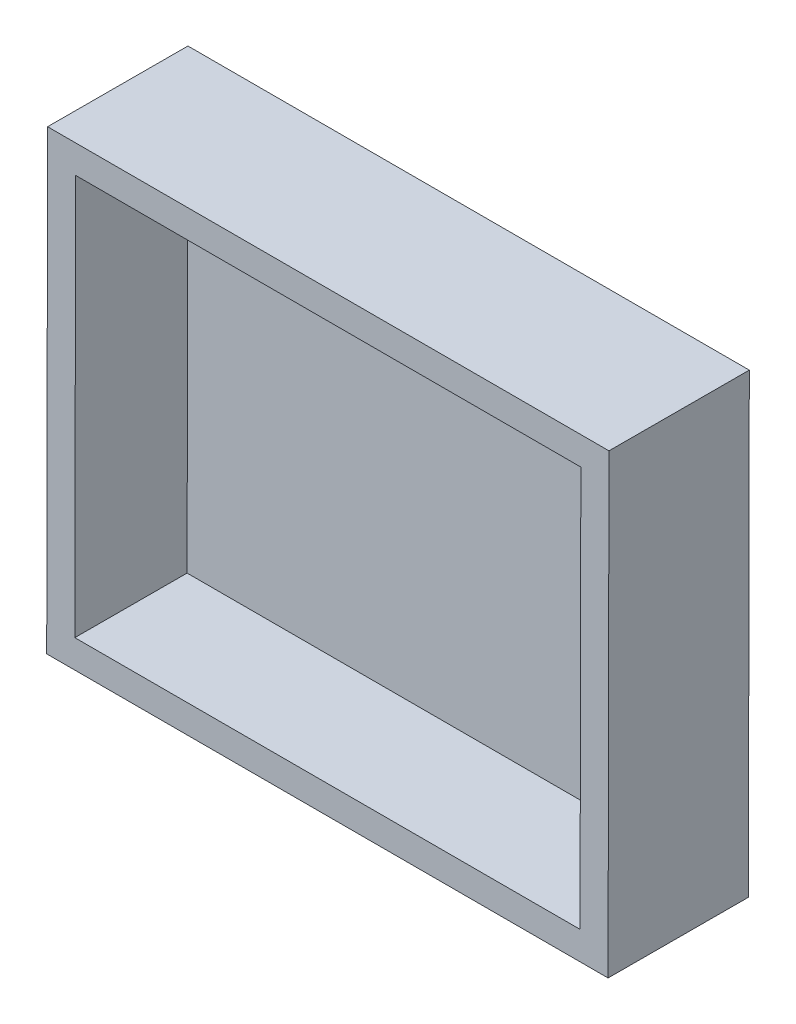
ISO-10303-21;
HEADER;
FILE_DESCRIPTION(('STEP AP214'),'2;1');
FILE_NAME('part.step','',(''),(''),'','','');
FILE_SCHEMA(('AUTOMOTIVE_DESIGN { 1 0 10303 214 1 1 1 1 }'));
ENDSEC;
DATA;
#1=APPLICATION_CONTEXT('core data for automotive mechanical design processes');
#2=APPLICATION_PROTOCOL_DEFINITION('international standard','automotive_design',2000,#1);
#3=PRODUCT_CONTEXT('',#1,'mechanical');
#4=PRODUCT('Part','Part','',(#3));
#5=PRODUCT_RELATED_PRODUCT_CATEGORY('part','',(#4));
#6=PRODUCT_DEFINITION_FORMATION('','',#4);
#7=PRODUCT_DEFINITION_CONTEXT('part definition',#1,'design');
#8=PRODUCT_DEFINITION('design','',#6,#7);
#9=PRODUCT_DEFINITION_SHAPE('','',#8);
#10=(LENGTH_UNIT() NAMED_UNIT(*) SI_UNIT(.MILLI.,.METRE.));
#11=(NAMED_UNIT(*) PLANE_ANGLE_UNIT() SI_UNIT($,.RADIAN.));
#12=(NAMED_UNIT(*) SI_UNIT($,.STERADIAN.) SOLID_ANGLE_UNIT());
#13=UNCERTAINTY_MEASURE_WITH_UNIT(LENGTH_MEASURE(1.E-05),#10,'distance_accuracy_value','');
#14=(GEOMETRIC_REPRESENTATION_CONTEXT(3) GLOBAL_UNCERTAINTY_ASSIGNED_CONTEXT((#13)) GLOBAL_UNIT_ASSIGNED_CONTEXT((#10,
#11,#12)) REPRESENTATION_CONTEXT('',''));
#15=CARTESIAN_POINT('',(0.,0.,0.));
#16=DIRECTION('',(0.,0.,1.));
#17=DIRECTION('',(1.,0.,0.));
#18=AXIS2_PLACEMENT_3D('',#15,#16,#17);
#19=CARTESIAN_POINT('',(-75.0639988479632,32.1451252430194,19.8847443341761));
#20=DIRECTION('',(1.,-2.29688322373399E-11,-1.17776077545555E-08));
#21=DIRECTION('',(-1.17776077545555E-08,0.,-1.));
#22=AXIS2_PLACEMENT_3D('',#19,#20,#21);
#23=PLANE('',#22);
#24=DIRECTION('',(0.,-0.999998098306605,0.0019502264416651));
#25=VECTOR('',#24,1.);
#26=CARTESIAN_POINT('',(-75.0639990835158,32.1061207141861,-0.115217631956002));
#27=LINE('',#26,#25);
#28=CARTESIAN_POINT('',(-75.0639990835158,32.1061207141861,-0.115217631956002));
#29=VERTEX_POINT('',#28);
#30=CARTESIAN_POINT('',(-75.0639990835158,-32.8936330254354,0.011546847555902));
#31=VERTEX_POINT('',#30);
#32=EDGE_CURVE('E108',#29,#31,#27,.T.);
#33=ORIENTED_EDGE('',*,*,#32,.T.);
#34=DIRECTION('',(-1.17776301515805E-08,-0.0019502264416651,-0.999998098306605));
#35=VECTOR('',#34,1.);
#36=CARTESIAN_POINT('',(-75.0639988479631,-32.8546284966021,20.011508813688));
#37=LINE('',#36,#35);
#38=CARTESIAN_POINT('',(-75.0639988479631,-32.8546284966021,20.011508813688));
#39=VERTEX_POINT('',#38);
#40=EDGE_CURVE('E11',#39,#31,#37,.T.);
#41=ORIENTED_EDGE('',*,*,#40,.F.);
#42=DIRECTION('',(0.,-0.999998098306605,0.0019502264416651));
#43=VECTOR('',#42,1.);
#44=CARTESIAN_POINT('',(-75.0639988479632,32.1451252430194,19.8847443341761));
#45=LINE('',#44,#43);
#46=CARTESIAN_POINT('',(-75.0639988479632,32.1451252430194,19.8847443341761));
#47=VERTEX_POINT('',#46);
#48=EDGE_CURVE('E117',#47,#39,#45,.T.);
#49=ORIENTED_EDGE('',*,*,#48,.F.);
#50=DIRECTION('',(-1.17776301515805E-08,-0.0019502264416651,-0.999998098306605));
#51=VECTOR('',#50,1.);
#52=CARTESIAN_POINT('',(-75.0639988479632,32.1451252430194,19.8847443341761));
#53=LINE('',#52,#51);
#54=EDGE_CURVE('E101',#47,#29,#53,.T.);
#55=ORIENTED_EDGE('',*,*,#54,.T.);
#56=EDGE_LOOP('',(#33,#41,#49,#55));
#57=FACE_BOUND('',#56,.T.);
#58=ADVANCED_FACE('F35',(#57),#23,.F.);
#59=CARTESIAN_POINT('',(4.93600192566122,-32.8546284984396,20.0115078714794));
#60=DIRECTION('',(0.,0.999998098306605,-0.0019502264416651));
#61=DIRECTION('',(0.,0.0019502264416651,0.999998098306605));
#62=AXIS2_PLACEMENT_3D('',#59,#60,#61);
#63=PLANE('',#62);
#64=DIRECTION('',(1.,-2.29689164535393E-11,-1.17776077542398E-08));
#65=VECTOR('',#64,1.);
#66=CARTESIAN_POINT('',(4.93600169010861,-32.8936330272729,0.0115459053472726));
#67=LINE('',#66,#65);
#68=CARTESIAN_POINT('',(4.93600169010861,-32.8936330272729,0.0115459053472726));
#69=VERTEX_POINT('',#68);
#70=EDGE_CURVE('E111',#31,#69,#67,.T.);
#71=ORIENTED_EDGE('',*,*,#70,.T.);
#72=DIRECTION('',(-1.17776301515805E-08,-0.0019502264416651,-0.999998098306605));
#73=VECTOR('',#72,1.);
#74=CARTESIAN_POINT('',(4.93600192566122,-32.8546284984396,20.0115078714794));
#75=LINE('',#74,#73);
#76=CARTESIAN_POINT('',(4.93600192566122,-32.8546284984396,20.0115078714794));
#77=VERTEX_POINT('',#76);
#78=EDGE_CURVE('E43',#77,#69,#75,.T.);
#79=ORIENTED_EDGE('',*,*,#78,.F.);
#80=DIRECTION('',(1.,-2.29702202117127E-11,-1.17776077523297E-08));
#81=VECTOR('',#80,1.);
#82=CARTESIAN_POINT('',(-75.0639988479631,-32.8546284966021,20.011508813688));
#83=LINE('',#82,#81);
#84=EDGE_CURVE('E82',#39,#77,#83,.T.);
#85=ORIENTED_EDGE('',*,*,#84,.F.);
#86=ORIENTED_EDGE('',*,*,#40,.T.);
#87=EDGE_LOOP('',(#71,#79,#85,#86));
#88=FACE_BOUND('',#87,.T.);
#89=ADVANCED_FACE('F211',(#88),#63,.F.);
#90=CARTESIAN_POINT('',(4.93600192566121,32.1451242871951,19.884743393828));
#91=DIRECTION('',(-1.,2.29689256455239E-11,1.17776077543733E-08));
#92=DIRECTION('',(1.17776077543733E-08,0.,1.));
#93=AXIS2_PLACEMENT_3D('',#90,#91,#92);
#94=PLANE('',#93);
#95=DIRECTION('',(0.,0.999998098306605,-0.0019502264416651));
#96=VECTOR('',#95,1.);
#97=CARTESIAN_POINT('',(4.93600169010861,32.1061197583618,-0.115218572304137));
#98=LINE('',#97,#96);
#99=CARTESIAN_POINT('',(4.93600169010861,32.1061197583618,-0.115218572304137));
#100=VERTEX_POINT('',#99);
#101=EDGE_CURVE('E100',#69,#100,#98,.T.);
#102=ORIENTED_EDGE('',*,*,#101,.T.);
#103=DIRECTION('',(-1.17776301515805E-08,-0.0019502264416651,-0.999998098306605));
#104=VECTOR('',#103,1.);
#105=CARTESIAN_POINT('',(4.93600192566121,32.1451242871951,19.884743393828));
#106=LINE('',#105,#104);
#107=CARTESIAN_POINT('',(4.93600192566121,32.1451242871951,19.884743393828));
#108=VERTEX_POINT('',#107);
#109=EDGE_CURVE('E97',#108,#100,#106,.T.);
#110=ORIENTED_EDGE('',*,*,#109,.F.);
#111=DIRECTION('',(0.,0.999998098306605,-0.0019502264416651));
#112=VECTOR('',#111,1.);
#113=CARTESIAN_POINT('',(4.93600192566121,32.1451242871951,19.884743393828));
#114=LINE('',#113,#112);
#115=EDGE_CURVE('E88',#77,#108,#114,.T.);
#116=ORIENTED_EDGE('',*,*,#115,.F.);
#117=ORIENTED_EDGE('',*,*,#78,.T.);
#118=EDGE_LOOP('',(#102,#110,#116,#117));
#119=FACE_BOUND('',#118,.T.);
#120=ADVANCED_FACE('F98',(#119),#94,.F.);
#121=CARTESIAN_POINT('',(-62.4959980037294,32.1451252427308,19.8847441861551));
#122=DIRECTION('',(0.,-0.999998098306605,0.0019502264416651));
#123=DIRECTION('',(0.,-0.0019502264416651,-0.999998098306605));
#124=AXIS2_PLACEMENT_3D('',#121,#122,#123);
#125=PLANE('',#124);
#126=DIRECTION('',(-1.,2.2968797326489E-11,1.1777607754044E-08));
#127=VECTOR('',#126,1.);
#128=CARTESIAN_POINT('',(-62.495998239282,32.1061207138975,-0.115217779976986));
#129=LINE('',#128,#127);
#130=CARTESIAN_POINT('',(-62.495998239282,32.1061207138975,-0.115217779976986));
#131=VERTEX_POINT('',#130);
#132=EDGE_CURVE('E74',#131,#29,#129,.T.);
#133=ORIENTED_EDGE('',*,*,#132,.T.);
#134=ORIENTED_EDGE('',*,*,#54,.F.);
#135=DIRECTION('',(-1.,2.2968797326489E-11,1.1777607754044E-08));
#136=VECTOR('',#135,1.);
#137=CARTESIAN_POINT('',(-62.4959980037294,32.1451252427308,19.8847441861551));
#138=LINE('',#137,#136);
#139=CARTESIAN_POINT('',(-62.4959980037294,32.1451252427308,19.8847441861551));
#140=VERTEX_POINT('',#139);
#141=EDGE_CURVE('E51',#140,#47,#138,.T.);
#142=ORIENTED_EDGE('',*,*,#141,.F.);
#143=DIRECTION('',(-1.,1.41703588358429E-08,1.17500170869422E-08));
#144=VECTOR('',#143,1.);
#145=CARTESIAN_POINT('',(4.93600192566121,32.1451242871951,19.884743393828));
#146=LINE('',#145,#144);
#147=EDGE_CURVE('E92',#108,#140,#146,.T.);
#148=ORIENTED_EDGE('',*,*,#147,.F.);
#149=ORIENTED_EDGE('',*,*,#109,.T.);
#150=DIRECTION('',(-1.,1.4170360004131E-08,1.17500170857195E-08));
#151=VECTOR('',#150,1.);
#152=CARTESIAN_POINT('',(-2.49599815401732,32.1061198636759,-0.115218484978012));
#153=LINE('',#152,#151);
#154=EDGE_CURVE('E71',#100,#131,#153,.T.);
#155=ORIENTED_EDGE('',*,*,#154,.T.);
#156=EDGE_LOOP('',(#133,#134,#142,#148,#149,#155));
#157=FACE_BOUND('',#156,.T.);
#158=ADVANCED_FACE('F103',(#157),#125,.F.);
#159=CARTESIAN_POINT('',(2.34933051499001E-07,0.0389019389433778,19.9473579748016));
#160=DIRECTION('',(1.17776301520616E-08,0.0019502264416651,0.999998098306605));
#161=DIRECTION('',(0.,-0.999998098306605,0.0019502264416651));
#162=AXIS2_PLACEMENT_3D('',#159,#160,#161);
#163=PLANE('',#162);
#164=DIRECTION('',(0.,-0.999998098306605,0.0019502264416651));
#165=VECTOR('',#164,1.);
#166=CARTESIAN_POINT('',(-71.0639988479632,32.1451252429276,19.8847442870657));
#167=LINE('',#166,#165);
#168=CARTESIAN_POINT('',(-71.0639988479632,28.1451328497011,19.8925451928323));
#169=VERTEX_POINT('',#168);
#170=CARTESIAN_POINT('',(-71.0639988479631,-28.8546361034676,20.0037078608109));
#171=VERTEX_POINT('',#170);
#172=EDGE_CURVE('E136',#169,#171,#167,.T.);
#173=ORIENTED_EDGE('',*,*,#172,.F.);
#174=DIRECTION('',(-1.,2.29687973285574E-11,1.17776077551046E-08));
#175=VECTOR('',#174,1.);
#176=CARTESIAN_POINT('',(-62.4959980037294,28.1451328495043,19.8925450919218));
#177=LINE('',#176,#175);
#178=CARTESIAN_POINT('',(0.936001925661209,28.1451328480474,19.8925443448446));
#179=VERTEX_POINT('',#178);
#180=EDGE_CURVE('E126',#179,#169,#177,.T.);
#181=ORIENTED_EDGE('',*,*,#180,.F.);
#182=DIRECTION('',(0.,0.999998098306605,-0.0019502264416651));
#183=VECTOR('',#182,1.);
#184=CARTESIAN_POINT('',(0.936001925661209,32.1451242872869,19.8847434409384));
#185=LINE('',#184,#183);
#186=CARTESIAN_POINT('',(0.936001925661216,-28.8546361051213,20.0037070128231));
#187=VERTEX_POINT('',#186);
#188=EDGE_CURVE('E130',#187,#179,#185,.T.);
#189=ORIENTED_EDGE('',*,*,#188,.F.);
#190=DIRECTION('',(1.,-2.29689164547729E-11,-1.17776077548723E-08));
#191=VECTOR('',#190,1.);
#192=CARTESIAN_POINT('',(4.93600192566122,-28.8546361052132,20.0037069657127));
#193=LINE('',#192,#191);
#194=EDGE_CURVE('E133',#171,#187,#193,.T.);
#195=ORIENTED_EDGE('',*,*,#194,.F.);
#196=EDGE_LOOP('',(#173,#181,#189,#195));
#197=FACE_BOUND('',#196,.T.);
#198=ORIENTED_EDGE('',*,*,#48,.T.);
#199=ORIENTED_EDGE('',*,*,#84,.T.);
#200=ORIENTED_EDGE('',*,*,#115,.T.);
#201=ORIENTED_EDGE('',*,*,#147,.T.);
#202=ORIENTED_EDGE('',*,*,#141,.T.);
#203=EDGE_LOOP('',(#198,#199,#200,#201,#202));
#204=FACE_BOUND('',#203,.T.);
#205=ADVANCED_FACE('F90',(#197,#204),#163,.T.);
#206=CARTESIAN_POINT('',(-6.19551532609474E-10,-0.000102589889924301,-0.0526039913304602));
#207=DIRECTION('',(1.17776301520616E-08,0.0019502264416651,0.999998098306605));
#208=DIRECTION('',(0.,-0.999998098306605,0.0019502264416651));
#209=AXIS2_PLACEMENT_3D('',#206,#207,#208);
#210=PLANE('',#209);
#211=ORIENTED_EDGE('',*,*,#32,.F.);
#212=ORIENTED_EDGE('',*,*,#132,.F.);
#213=ORIENTED_EDGE('',*,*,#154,.F.);
#214=ORIENTED_EDGE('',*,*,#101,.F.);
#215=ORIENTED_EDGE('',*,*,#70,.F.);
#216=EDGE_LOOP('',(#211,#212,#213,#214,#215));
#217=FACE_BOUND('',#216,.T.);
#218=ADVANCED_FACE('F120',(#217),#210,.F.);
#219=CARTESIAN_POINT('',(-71.0639988479632,32.1451252429276,19.8847442870657));
#220=DIRECTION('',(1.,-2.29688322373399E-11,-1.17776077545555E-08));
#221=DIRECTION('',(-1.17776077545555E-08,0.,-1.));
#222=AXIS2_PLACEMENT_3D('',#219,#220,#221);
#223=PLANE('',#222);
#224=DIRECTION('',(0.,-0.999998098306605,0.0019502264416651));
#225=VECTOR('',#224,1.);
#226=CARTESIAN_POINT('',(-71.0639990364052,32.1139216198609,3.88477471415999));
#227=LINE('',#226,#225);
#228=CARTESIAN_POINT('',(-71.0639990364052,28.1139292266345,3.89257561992665));
#229=VERTEX_POINT('',#228);
#230=CARTESIAN_POINT('',(-71.0639990364052,-28.8858397265342,4.00373828790523));
#231=VERTEX_POINT('',#230);
#232=EDGE_CURVE('E157',#229,#231,#227,.T.);
#233=ORIENTED_EDGE('',*,*,#232,.F.);
#234=DIRECTION('',(-1.17776301515805E-08,-0.0019502264416651,-0.999998098306605));
#235=VECTOR('',#234,1.);
#236=CARTESIAN_POINT('',(-71.0639988479632,28.1451328497011,19.8925451928323));
#237=LINE('',#236,#235);
#238=EDGE_CURVE('E129',#169,#229,#237,.T.);
#239=ORIENTED_EDGE('',*,*,#238,.F.);
#240=ORIENTED_EDGE('',*,*,#172,.T.);
#241=DIRECTION('',(-1.17776301515805E-08,-0.0019502264416651,-0.999998098306605));
#242=VECTOR('',#241,1.);
#243=CARTESIAN_POINT('',(-71.0639988479631,-28.8546361034676,20.0037078608109));
#244=LINE('',#243,#242);
#245=EDGE_CURVE('E112',#171,#231,#244,.T.);
#246=ORIENTED_EDGE('',*,*,#245,.T.);
#247=EDGE_LOOP('',(#233,#239,#240,#246));
#248=FACE_BOUND('',#247,.T.);
#249=ADVANCED_FACE('F174',(#248),#223,.T.);
#250=CARTESIAN_POINT('',(4.93600192566122,-28.8546361052132,20.0037069657127));
#251=DIRECTION('',(0.,0.999998098306605,-0.0019502264416651));
#252=DIRECTION('',(0.,0.0019502264416651,0.999998098306605));
#253=AXIS2_PLACEMENT_3D('',#250,#251,#252);
#254=PLANE('',#253);
#255=DIRECTION('',(1.,-2.29689164547729E-11,-1.17776077548723E-08));
#256=VECTOR('',#255,1.);
#257=CARTESIAN_POINT('',(4.93600173721913,-28.8858397282798,4.00373739280703));
#258=LINE('',#257,#256);
#259=CARTESIAN_POINT('',(0.936001737219134,-28.885839728188,4.00373743991746));
#260=VERTEX_POINT('',#259);
#261=EDGE_CURVE('E152',#231,#260,#258,.T.);
#262=ORIENTED_EDGE('',*,*,#261,.F.);
#263=ORIENTED_EDGE('',*,*,#245,.F.);
#264=ORIENTED_EDGE('',*,*,#194,.T.);
#265=DIRECTION('',(-1.17776301515805E-08,-0.0019502264416651,-0.999998098306605));
#266=VECTOR('',#265,1.);
#267=CARTESIAN_POINT('',(0.936001925661216,-28.8546361051213,20.0037070128231));
#268=LINE('',#267,#266);
#269=EDGE_CURVE('E149',#187,#260,#268,.T.);
#270=ORIENTED_EDGE('',*,*,#269,.T.);
#271=EDGE_LOOP('',(#262,#263,#264,#270));
#272=FACE_BOUND('',#271,.T.);
#273=ADVANCED_FACE('F199',(#272),#254,.T.);
#274=CARTESIAN_POINT('',(0.936001925661209,32.1451242872869,19.8847434409384));
#275=DIRECTION('',(-1.,2.29689256455239E-11,1.17776077543733E-08));
#276=DIRECTION('',(1.17776077543733E-08,0.,1.));
#277=AXIS2_PLACEMENT_3D('',#274,#275,#276);
#278=PLANE('',#277);
#279=DIRECTION('',(0.,0.999998098306605,-0.0019502264416651));
#280=VECTOR('',#279,1.);
#281=CARTESIAN_POINT('',(0.936001737219126,32.1139206642203,3.88477386803271));
#282=LINE('',#281,#280);
#283=CARTESIAN_POINT('',(0.936001737219127,28.1139292249807,3.89257477193888));
#284=VERTEX_POINT('',#283);
#285=EDGE_CURVE('E143',#260,#284,#282,.T.);
#286=ORIENTED_EDGE('',*,*,#285,.F.);
#287=ORIENTED_EDGE('',*,*,#269,.F.);
#288=ORIENTED_EDGE('',*,*,#188,.T.);
#289=DIRECTION('',(-1.17776301515805E-08,-0.0019502264416651,-0.999998098306605));
#290=VECTOR('',#289,1.);
#291=CARTESIAN_POINT('',(0.936001925661213,28.1451328480474,19.8925443448446));
#292=LINE('',#291,#290);
#293=EDGE_CURVE('E146',#179,#284,#292,.T.);
#294=ORIENTED_EDGE('',*,*,#293,.T.);
#295=EDGE_LOOP('',(#286,#287,#288,#294));
#296=FACE_BOUND('',#295,.T.);
#297=ADVANCED_FACE('F201',(#296),#278,.T.);
#298=CARTESIAN_POINT('',(-62.4959980037294,28.1451328495043,19.8925450919218));
#299=DIRECTION('',(0.,-0.999998098306605,0.0019502264416651));
#300=DIRECTION('',(0.,-0.0019502264416651,-0.999998098306605));
#301=AXIS2_PLACEMENT_3D('',#298,#299,#300);
#302=PLANE('',#301);
#303=DIRECTION('',(-1.,2.29687973285574E-11,1.17776077551046E-08));
#304=VECTOR('',#303,1.);
#305=CARTESIAN_POINT('',(-62.4959981921714,28.1139292264377,3.89257551901609));
#306=LINE('',#305,#304);
#307=CARTESIAN_POINT('',(-62.4959981921714,28.1139292264377,3.89257551901609));
#308=VERTEX_POINT('',#307);
#309=EDGE_CURVE('E139',#308,#229,#306,.T.);
#310=ORIENTED_EDGE('',*,*,#309,.F.);
#311=DIRECTION('',(-1.,2.29687973285574E-11,1.17776077551046E-08));
#312=VECTOR('',#311,1.);
#313=CARTESIAN_POINT('',(-62.4959981921714,28.1139292264377,3.89257551901609));
#314=LINE('',#313,#312);
#315=EDGE_CURVE('E140',#284,#308,#314,.T.);
#316=ORIENTED_EDGE('',*,*,#315,.F.);
#317=ORIENTED_EDGE('',*,*,#293,.F.);
#318=ORIENTED_EDGE('',*,*,#180,.T.);
#319=ORIENTED_EDGE('',*,*,#238,.T.);
#320=EDGE_LOOP('',(#310,#316,#317,#318,#319));
#321=FACE_BOUND('',#320,.T.);
#322=ADVANCED_FACE('F195',(#321),#302,.T.);
#323=CARTESIAN_POINT('',(4.6490969075637E-08,0.00769831587673612,3.94738840189596));
#324=DIRECTION('',(1.17776301520616E-08,0.0019502264416651,0.999998098306605));
#325=DIRECTION('',(0.,-0.999998098306605,0.0019502264416651));
#326=AXIS2_PLACEMENT_3D('',#323,#324,#325);
#327=PLANE('',#326);
#328=ORIENTED_EDGE('',*,*,#232,.T.);
#329=ORIENTED_EDGE('',*,*,#261,.T.);
#330=ORIENTED_EDGE('',*,*,#285,.T.);
#331=ORIENTED_EDGE('',*,*,#315,.T.);
#332=ORIENTED_EDGE('',*,*,#309,.T.);
#333=EDGE_LOOP('',(#328,#329,#330,#331,#332));
#334=FACE_BOUND('',#333,.T.);
#335=ADVANCED_FACE('F166',(#334),#327,.T.);
#336=CLOSED_SHELL('',(#58,#89,#120,#158,#205,#218,#249,#273,#297,#322,#335));
#337=MANIFOLD_SOLID_BREP('B2',#336);
#338=ADVANCED_BREP_SHAPE_REPRESENTATION('',(#18,#337),#14);
#339=SHAPE_DEFINITION_REPRESENTATION(#9,#338);
ENDSEC;
END-ISO-10303-21;
